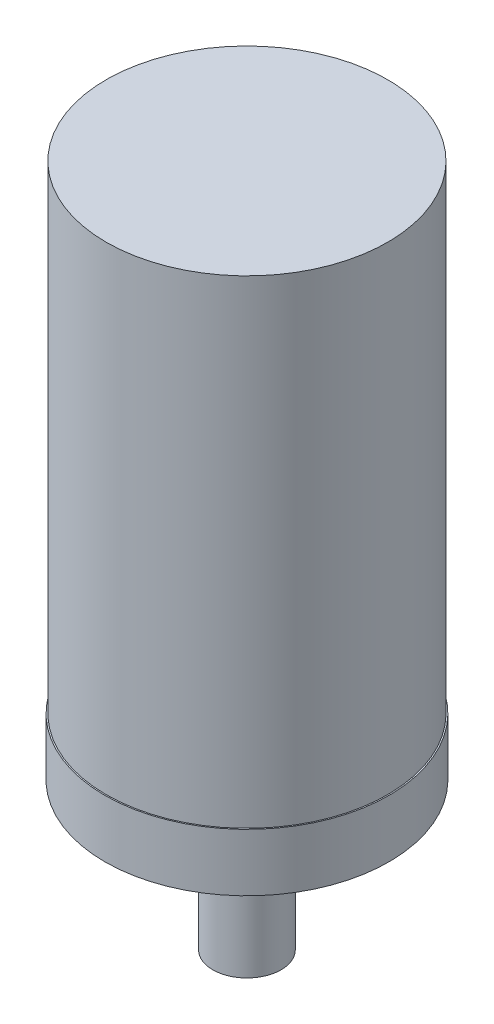
ISO-10303-21;
HEADER;
FILE_DESCRIPTION(('STEP AP214'),'2;1');
FILE_NAME('part.step','',(''),(''),'','','');
FILE_SCHEMA(('AUTOMOTIVE_DESIGN { 1 0 10303 214 1 1 1 1 }'));
ENDSEC;
DATA;
#1=APPLICATION_CONTEXT('core data for automotive mechanical design processes');
#2=APPLICATION_PROTOCOL_DEFINITION('international standard','automotive_design',2000,#1);
#3=PRODUCT_CONTEXT('',#1,'mechanical');
#4=PRODUCT('Part','Part','',(#3));
#5=PRODUCT_RELATED_PRODUCT_CATEGORY('part','',(#4));
#6=PRODUCT_DEFINITION_FORMATION('','',#4);
#7=PRODUCT_DEFINITION_CONTEXT('part definition',#1,'design');
#8=PRODUCT_DEFINITION('design','',#6,#7);
#9=PRODUCT_DEFINITION_SHAPE('','',#8);
#10=(LENGTH_UNIT() NAMED_UNIT(*) SI_UNIT(.MILLI.,.METRE.));
#11=(NAMED_UNIT(*) PLANE_ANGLE_UNIT() SI_UNIT($,.RADIAN.));
#12=(NAMED_UNIT(*) SI_UNIT($,.STERADIAN.) SOLID_ANGLE_UNIT());
#13=UNCERTAINTY_MEASURE_WITH_UNIT(LENGTH_MEASURE(1.E-05),#10,'distance_accuracy_value','');
#14=(GEOMETRIC_REPRESENTATION_CONTEXT(3) GLOBAL_UNCERTAINTY_ASSIGNED_CONTEXT((#13)) GLOBAL_UNIT_ASSIGNED_CONTEXT((#10,
#11,#12)) REPRESENTATION_CONTEXT('',''));
#15=CARTESIAN_POINT('',(0.,0.,0.));
#16=DIRECTION('',(0.,0.,1.));
#17=DIRECTION('',(1.,0.,0.));
#18=AXIS2_PLACEMENT_3D('',#15,#16,#17);
#19=CARTESIAN_POINT('',(0.,0.,0.));
#20=DIRECTION('',(0.,1.,0.));
#21=DIRECTION('',(0.,0.,1.));
#22=AXIS2_PLACEMENT_3D('',#19,#20,#21);
#23=PLANE('',#22);
#24=CARTESIAN_POINT('',(0.,0.,0.));
#25=DIRECTION('',(0.,1.,0.));
#26=DIRECTION('',(0.,0.,1.));
#27=AXIS2_PLACEMENT_3D('',#24,#25,#26);
#28=CIRCLE('',#27,9.5);
#29=CARTESIAN_POINT('',(0.,0.,9.5));
#30=VERTEX_POINT('',#29);
#31=EDGE_CURVE('E37',#30,#30,#28,.T.);
#32=ORIENTED_EDGE('',*,*,#31,.F.);
#33=EDGE_LOOP('',(#32));
#34=FACE_BOUND('',#33,.T.);
#35=CARTESIAN_POINT('',(0.,0.,0.));
#36=DIRECTION('',(0.,1.,0.));
#37=DIRECTION('',(0.,0.,1.));
#38=AXIS2_PLACEMENT_3D('',#35,#36,#37);
#39=CIRCLE('',#38,8.2);
#40=CARTESIAN_POINT('',(0.,0.,8.2));
#41=VERTEX_POINT('',#40);
#42=EDGE_CURVE('E62',#41,#41,#39,.T.);
#43=ORIENTED_EDGE('',*,*,#42,.T.);
#44=EDGE_LOOP('',(#43));
#45=FACE_BOUND('',#44,.T.);
#46=ADVANCED_FACE('F33',(#34,#45),#23,.F.);
#47=CARTESIAN_POINT('',(0.,35.,0.));
#48=DIRECTION('',(0.,-1.,0.));
#49=DIRECTION('',(0.,0.,-1.));
#50=AXIS2_PLACEMENT_3D('',#47,#48,#49);
#51=CYLINDRICAL_SURFACE('',#50,9.5);
#52=CARTESIAN_POINT('',(0.,35.,0.));
#53=DIRECTION('',(0.,1.,0.));
#54=DIRECTION('',(0.,0.,1.));
#55=AXIS2_PLACEMENT_3D('',#52,#53,#54);
#56=CIRCLE('',#55,9.5);
#57=CARTESIAN_POINT('',(0.,35.,9.5));
#58=VERTEX_POINT('',#57);
#59=EDGE_CURVE('E41',#58,#58,#56,.T.);
#60=ORIENTED_EDGE('',*,*,#59,.F.);
#61=EDGE_LOOP('',(#60));
#62=FACE_BOUND('',#61,.T.);
#63=ORIENTED_EDGE('',*,*,#31,.T.);
#64=EDGE_LOOP('',(#63));
#65=FACE_BOUND('',#64,.T.);
#66=ADVANCED_FACE('F35',(#62,#65),#51,.T.);
#67=CARTESIAN_POINT('',(0.,35.,0.));
#68=DIRECTION('',(0.,-1.,0.));
#69=DIRECTION('',(0.,0.,-1.));
#70=AXIS2_PLACEMENT_3D('',#67,#68,#69);
#71=CYLINDRICAL_SURFACE('',#70,8.2);
#72=ORIENTED_EDGE('',*,*,#42,.F.);
#73=EDGE_LOOP('',(#72));
#74=FACE_BOUND('',#73,.T.);
#75=CARTESIAN_POINT('',(0.,36.0657450735341,0.));
#76=DIRECTION('',(0.,1.,0.));
#77=DIRECTION('',(0.,0.,1.));
#78=AXIS2_PLACEMENT_3D('',#75,#76,#77);
#79=CIRCLE('',#78,8.2);
#80=CARTESIAN_POINT('',(0.,36.0657450735341,8.2));
#81=VERTEX_POINT('',#80);
#82=EDGE_CURVE('E50',#81,#81,#79,.T.);
#83=ORIENTED_EDGE('',*,*,#82,.T.);
#84=EDGE_LOOP('',(#83));
#85=FACE_BOUND('',#84,.T.);
#86=ADVANCED_FACE('F76',(#74,#85),#71,.F.);
#87=CARTESIAN_POINT('',(0.,41.,0.));
#88=DIRECTION('',(0.,1.,0.));
#89=DIRECTION('',(0.,0.,1.));
#90=AXIS2_PLACEMENT_3D('',#87,#88,#89);
#91=CONICAL_SURFACE('',#90,39.5,1.37340076694502);
#92=ORIENTED_EDGE('',*,*,#59,.T.);
#93=EDGE_LOOP('',(#92));
#94=FACE_BOUND('',#93,.T.);
#95=CARTESIAN_POINT('',(0.,41.,0.));
#96=DIRECTION('',(0.,1.,0.));
#97=DIRECTION('',(0.,0.,1.));
#98=AXIS2_PLACEMENT_3D('',#95,#96,#97);
#99=CIRCLE('',#98,39.5);
#100=CARTESIAN_POINT('',(0.,41.,39.5));
#101=VERTEX_POINT('',#100);
#102=EDGE_CURVE('E59',#101,#101,#99,.T.);
#103=ORIENTED_EDGE('',*,*,#102,.F.);
#104=EDGE_LOOP('',(#103));
#105=FACE_BOUND('',#104,.T.);
#106=ADVANCED_FACE('F81',(#94,#105),#91,.T.);
#107=CARTESIAN_POINT('',(0.,35.,0.));
#108=DIRECTION('',(0.,1.,0.));
#109=DIRECTION('',(0.,0.,1.));
#110=AXIS2_PLACEMENT_3D('',#107,#108,#109);
#111=CYLINDRICAL_SURFACE('',#110,39.5);
#112=ORIENTED_EDGE('',*,*,#102,.T.);
#113=EDGE_LOOP('',(#112));
#114=FACE_BOUND('',#113,.T.);
#115=CARTESIAN_POINT('',(0.,57.,0.));
#116=DIRECTION('',(0.,1.,0.));
#117=DIRECTION('',(0.,0.,1.));
#118=AXIS2_PLACEMENT_3D('',#115,#116,#117);
#119=CIRCLE('',#118,39.5);
#120=CARTESIAN_POINT('',(0.,57.,39.5));
#121=VERTEX_POINT('',#120);
#122=EDGE_CURVE('E56',#121,#121,#119,.T.);
#123=ORIENTED_EDGE('',*,*,#122,.F.);
#124=EDGE_LOOP('',(#123));
#125=FACE_BOUND('',#124,.T.);
#126=ADVANCED_FACE('F84',(#114,#125),#111,.T.);
#127=CARTESIAN_POINT('',(-39.5,57.,0.));
#128=DIRECTION('',(0.,1.,0.));
#129=DIRECTION('',(0.,0.,1.));
#130=AXIS2_PLACEMENT_3D('',#127,#128,#129);
#131=PLANE('',#130);
#132=CARTESIAN_POINT('',(0.,57.,0.));
#133=DIRECTION('',(0.,1.,0.));
#134=DIRECTION('',(0.,0.,1.));
#135=AXIS2_PLACEMENT_3D('',#132,#133,#134);
#136=CIRCLE('',#135,39.1370426579478);
#137=CARTESIAN_POINT('',(0.,57.,39.1370426579478));
#138=VERTEX_POINT('',#137);
#139=EDGE_CURVE('E10',#138,#138,#136,.T.);
#140=ORIENTED_EDGE('',*,*,#139,.F.);
#141=EDGE_LOOP('',(#140));
#142=FACE_BOUND('',#141,.T.);
#143=ORIENTED_EDGE('',*,*,#122,.T.);
#144=EDGE_LOOP('',(#143));
#145=FACE_BOUND('',#144,.T.);
#146=ADVANCED_FACE('F87',(#142,#145),#131,.T.);
#147=CARTESIAN_POINT('',(0.,35.,0.));
#148=DIRECTION('',(0.,1.,0.));
#149=DIRECTION('',(0.,0.,1.));
#150=AXIS2_PLACEMENT_3D('',#147,#148,#149);
#151=CYLINDRICAL_SURFACE('',#150,38.2);
#152=CARTESIAN_POINT('',(0.,42.0657450735341,0.));
#153=DIRECTION('',(0.,1.,0.));
#154=DIRECTION('',(0.,0.,1.));
#155=AXIS2_PLACEMENT_3D('',#152,#153,#154);
#156=CIRCLE('',#155,38.2);
#157=CARTESIAN_POINT('',(0.,42.0657450735341,38.2));
#158=VERTEX_POINT('',#157);
#159=EDGE_CURVE('E53',#158,#158,#156,.T.);
#160=ORIENTED_EDGE('',*,*,#159,.F.);
#161=EDGE_LOOP('',(#160));
#162=FACE_BOUND('',#161,.T.);
#163=CARTESIAN_POINT('',(0.,187.,0.));
#164=DIRECTION('',(0.,1.,0.));
#165=DIRECTION('',(0.,0.,1.));
#166=AXIS2_PLACEMENT_3D('',#163,#164,#165);
#167=CIRCLE('',#166,38.2);
#168=CARTESIAN_POINT('',(0.,187.,38.2));
#169=VERTEX_POINT('',#168);
#170=EDGE_CURVE('E48',#169,#169,#167,.T.);
#171=ORIENTED_EDGE('',*,*,#170,.T.);
#172=EDGE_LOOP('',(#171));
#173=FACE_BOUND('',#172,.T.);
#174=ADVANCED_FACE('F91',(#162,#173),#151,.F.);
#175=CARTESIAN_POINT('',(0.,36.0657450735341,0.));
#176=DIRECTION('',(0.,1.,0.));
#177=DIRECTION('',(0.,0.,1.));
#178=AXIS2_PLACEMENT_3D('',#175,#176,#177);
#179=CONICAL_SURFACE('',#178,8.2,1.37340076694502);
#180=ORIENTED_EDGE('',*,*,#159,.T.);
#181=EDGE_LOOP('',(#180));
#182=FACE_BOUND('',#181,.T.);
#183=ORIENTED_EDGE('',*,*,#82,.F.);
#184=EDGE_LOOP('',(#183));
#185=FACE_BOUND('',#184,.T.);
#186=ADVANCED_FACE('F95',(#182,#185),#179,.F.);
#187=CARTESIAN_POINT('',(0.,187.,0.));
#188=DIRECTION('',(0.,-1.,0.));
#189=DIRECTION('',(0.,0.,-1.));
#190=AXIS2_PLACEMENT_3D('',#187,#188,#189);
#191=CYLINDRICAL_SURFACE('',#190,39.1370426579478);
#192=ORIENTED_EDGE('',*,*,#139,.T.);
#193=EDGE_LOOP('',(#192));
#194=FACE_BOUND('',#193,.T.);
#195=CARTESIAN_POINT('',(0.,190.,0.));
#196=DIRECTION('',(0.,1.,0.));
#197=DIRECTION('',(0.,0.,1.));
#198=AXIS2_PLACEMENT_3D('',#195,#196,#197);
#199=CIRCLE('',#198,39.1370426579478);
#200=CARTESIAN_POINT('',(0.,190.,39.1370426579478));
#201=VERTEX_POINT('',#200);
#202=EDGE_CURVE('E114',#201,#201,#199,.T.);
#203=ORIENTED_EDGE('',*,*,#202,.F.);
#204=EDGE_LOOP('',(#203));
#205=FACE_BOUND('',#204,.T.);
#206=ADVANCED_FACE('F99',(#194,#205),#191,.T.);
#207=CARTESIAN_POINT('',(0.,187.,0.));
#208=DIRECTION('',(0.,1.,0.));
#209=DIRECTION('',(0.,0.,1.));
#210=AXIS2_PLACEMENT_3D('',#207,#208,#209);
#211=PLANE('',#210);
#212=ORIENTED_EDGE('',*,*,#170,.F.);
#213=EDGE_LOOP('',(#212));
#214=FACE_BOUND('',#213,.T.);
#215=ADVANCED_FACE('F103',(#214),#211,.F.);
#216=CARTESIAN_POINT('',(0.,190.,0.));
#217=DIRECTION('',(0.,1.,0.));
#218=DIRECTION('',(0.,0.,1.));
#219=AXIS2_PLACEMENT_3D('',#216,#217,#218);
#220=PLANE('',#219);
#221=ORIENTED_EDGE('',*,*,#202,.T.);
#222=EDGE_LOOP('',(#221));
#223=FACE_BOUND('',#222,.T.);
#224=ADVANCED_FACE('F106',(#223),#220,.T.);
#225=CLOSED_SHELL('',(#46,#66,#86,#106,#126,#146,#174,#186,#206,#215,#224));
#226=MANIFOLD_SOLID_BREP('B2',#225);
#227=ADVANCED_BREP_SHAPE_REPRESENTATION('',(#18,#226),#14);
#228=SHAPE_DEFINITION_REPRESENTATION(#9,#227);
ENDSEC;
END-ISO-10303-21;
